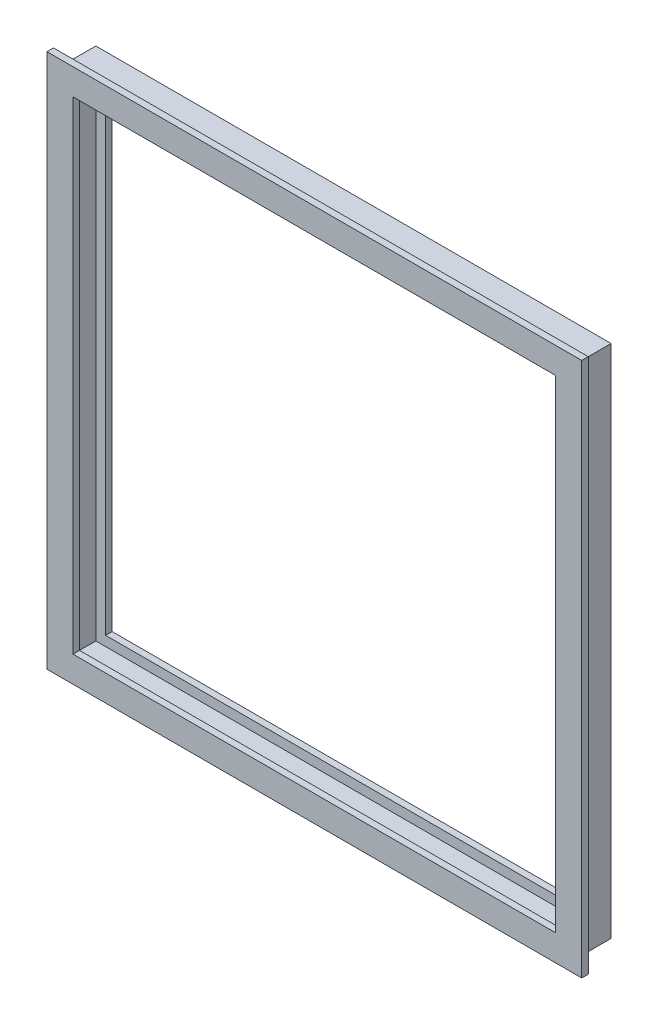
ISO-10303-21;
HEADER;
FILE_DESCRIPTION(('STEP AP214'),'2;1');
FILE_NAME('part.step','',(''),(''),'','','');
FILE_SCHEMA(('AUTOMOTIVE_DESIGN { 1 0 10303 214 1 1 1 1 }'));
ENDSEC;
DATA;
#1=APPLICATION_CONTEXT('core data for automotive mechanical design processes');
#2=APPLICATION_PROTOCOL_DEFINITION('international standard','automotive_design',2000,#1);
#3=PRODUCT_CONTEXT('',#1,'mechanical');
#4=PRODUCT('Part','Part','',(#3));
#5=PRODUCT_RELATED_PRODUCT_CATEGORY('part','',(#4));
#6=PRODUCT_DEFINITION_FORMATION('','',#4);
#7=PRODUCT_DEFINITION_CONTEXT('part definition',#1,'design');
#8=PRODUCT_DEFINITION('design','',#6,#7);
#9=PRODUCT_DEFINITION_SHAPE('','',#8);
#10=(LENGTH_UNIT() NAMED_UNIT(*) SI_UNIT(.MILLI.,.METRE.));
#11=(NAMED_UNIT(*) PLANE_ANGLE_UNIT() SI_UNIT($,.RADIAN.));
#12=(NAMED_UNIT(*) SI_UNIT($,.STERADIAN.) SOLID_ANGLE_UNIT());
#13=UNCERTAINTY_MEASURE_WITH_UNIT(LENGTH_MEASURE(1.E-05),#10,'distance_accuracy_value','');
#14=(GEOMETRIC_REPRESENTATION_CONTEXT(3) GLOBAL_UNCERTAINTY_ASSIGNED_CONTEXT((#13)) GLOBAL_UNIT_ASSIGNED_CONTEXT((#10,
#11,#12)) REPRESENTATION_CONTEXT('',''));
#15=CARTESIAN_POINT('',(0.,0.,0.));
#16=DIRECTION('',(0.,0.,1.));
#17=DIRECTION('',(1.,0.,0.));
#18=AXIS2_PLACEMENT_3D('',#15,#16,#17);
#19=CARTESIAN_POINT('',(130.75125,-117.475,-4.7625));
#20=DIRECTION('',(0.,1.,0.));
#21=DIRECTION('',(-1.,0.,0.));
#22=AXIS2_PLACEMENT_3D('',#19,#20,#21);
#23=PLANE('',#22);
#24=DIRECTION('',(-1.,0.,0.));
#25=VECTOR('',#24,1.);
#26=CARTESIAN_POINT('',(130.75125,-117.475,-7.9375));
#27=LINE('',#26,#25);
#28=CARTESIAN_POINT('',(117.475,-117.475,-7.9375));
#29=VERTEX_POINT('',#28);
#30=CARTESIAN_POINT('',(-117.475,-117.475,-7.9375));
#31=VERTEX_POINT('',#30);
#32=EDGE_CURVE('E38',#29,#31,#27,.T.);
#33=ORIENTED_EDGE('',*,*,#32,.T.);
#34=DIRECTION('',(0.,0.,1.));
#35=VECTOR('',#34,1.);
#36=CARTESIAN_POINT('',(-117.475,-117.475,-4.7625));
#37=LINE('',#36,#35);
#38=CARTESIAN_POINT('',(-117.475,-117.475,-4.7625));
#39=VERTEX_POINT('',#38);
#40=EDGE_CURVE('E124',#31,#39,#37,.T.);
#41=ORIENTED_EDGE('',*,*,#40,.T.);
#42=DIRECTION('',(-1.,0.,0.));
#43=VECTOR('',#42,1.);
#44=CARTESIAN_POINT('',(130.75125,-117.475,-4.7625));
#45=LINE('',#44,#43);
#46=CARTESIAN_POINT('',(117.475,-117.475,-4.7625));
#47=VERTEX_POINT('',#46);
#48=EDGE_CURVE('E158',#47,#39,#45,.T.);
#49=ORIENTED_EDGE('',*,*,#48,.F.);
#50=DIRECTION('',(0.,0.,1.));
#51=VECTOR('',#50,1.);
#52=CARTESIAN_POINT('',(117.475,-117.475,-4.7625));
#53=LINE('',#52,#51);
#54=EDGE_CURVE('E127',#29,#47,#53,.T.);
#55=ORIENTED_EDGE('',*,*,#54,.F.);
#56=EDGE_LOOP('',(#33,#41,#49,#55));
#57=FACE_BOUND('',#56,.T.);
#58=ADVANCED_FACE('F35',(#57),#23,.T.);
#59=CARTESIAN_POINT('',(130.75125,-122.2375,7.93749999999999));
#60=DIRECTION('',(0.,1.,0.));
#61=DIRECTION('',(-1.,0.,0.));
#62=AXIS2_PLACEMENT_3D('',#59,#60,#61);
#63=PLANE('',#62);
#64=DIRECTION('',(-1.,0.,0.));
#65=VECTOR('',#64,1.);
#66=CARTESIAN_POINT('',(130.75125,-122.2375,-4.76250000000001));
#67=LINE('',#66,#65);
#68=CARTESIAN_POINT('',(122.2375,-122.2375,-4.76250000000001));
#69=VERTEX_POINT('',#68);
#70=CARTESIAN_POINT('',(-122.2375,-122.2375,-4.76250000000001));
#71=VERTEX_POINT('',#70);
#72=EDGE_CURVE('E160',#69,#71,#67,.T.);
#73=ORIENTED_EDGE('',*,*,#72,.T.);
#74=DIRECTION('',(0.,0.,1.));
#75=VECTOR('',#74,1.);
#76=CARTESIAN_POINT('',(-122.2375,-122.2375,7.93749999999999));
#77=LINE('',#76,#75);
#78=CARTESIAN_POINT('',(-122.2375,-122.2375,7.93749999999999));
#79=VERTEX_POINT('',#78);
#80=EDGE_CURVE('E142',#71,#79,#77,.T.);
#81=ORIENTED_EDGE('',*,*,#80,.T.);
#82=DIRECTION('',(-1.,0.,0.));
#83=VECTOR('',#82,1.);
#84=CARTESIAN_POINT('',(130.75125,-122.2375,7.93749999999999));
#85=LINE('',#84,#83);
#86=CARTESIAN_POINT('',(122.2375,-122.2375,7.93749999999999));
#87=VERTEX_POINT('',#86);
#88=EDGE_CURVE('E162',#87,#79,#85,.T.);
#89=ORIENTED_EDGE('',*,*,#88,.F.);
#90=DIRECTION('',(0.,0.,1.));
#91=VECTOR('',#90,1.);
#92=CARTESIAN_POINT('',(122.2375,-122.2375,7.93749999999999));
#93=LINE('',#92,#91);
#94=EDGE_CURVE('E242',#69,#87,#93,.T.);
#95=ORIENTED_EDGE('',*,*,#94,.F.);
#96=EDGE_LOOP('',(#73,#81,#89,#95));
#97=FACE_BOUND('',#96,.T.);
#98=ADVANCED_FACE('F370',(#97),#63,.T.);
#99=CARTESIAN_POINT('',(130.75125,-117.475,11.1125));
#100=DIRECTION('',(0.,1.,0.));
#101=DIRECTION('',(-1.,0.,0.));
#102=AXIS2_PLACEMENT_3D('',#99,#100,#101);
#103=PLANE('',#102);
#104=DIRECTION('',(-1.,0.,0.));
#105=VECTOR('',#104,1.);
#106=CARTESIAN_POINT('',(130.75125,-117.475,7.9375));
#107=LINE('',#106,#105);
#108=CARTESIAN_POINT('',(117.475,-117.475,7.9375));
#109=VERTEX_POINT('',#108);
#110=CARTESIAN_POINT('',(-117.475,-117.475,7.9375));
#111=VERTEX_POINT('',#110);
#112=EDGE_CURVE('E165',#109,#111,#107,.T.);
#113=ORIENTED_EDGE('',*,*,#112,.T.);
#114=DIRECTION('',(0.,0.,1.));
#115=VECTOR('',#114,1.);
#116=CARTESIAN_POINT('',(-117.475,-117.475,11.1125));
#117=LINE('',#116,#115);
#118=CARTESIAN_POINT('',(-117.475,-117.475,11.1125));
#119=VERTEX_POINT('',#118);
#120=EDGE_CURVE('E272',#111,#119,#117,.T.);
#121=ORIENTED_EDGE('',*,*,#120,.T.);
#122=DIRECTION('',(-1.,0.,0.));
#123=VECTOR('',#122,1.);
#124=CARTESIAN_POINT('',(130.75125,-117.475,11.1125));
#125=LINE('',#124,#123);
#126=CARTESIAN_POINT('',(117.475,-117.475,11.1125));
#127=VERTEX_POINT('',#126);
#128=EDGE_CURVE('E167',#127,#119,#125,.T.);
#129=ORIENTED_EDGE('',*,*,#128,.F.);
#130=DIRECTION('',(0.,0.,1.));
#131=VECTOR('',#130,1.);
#132=CARTESIAN_POINT('',(117.475,-117.475,11.1125));
#133=LINE('',#132,#131);
#134=EDGE_CURVE('E239',#109,#127,#133,.T.);
#135=ORIENTED_EDGE('',*,*,#134,.F.);
#136=EDGE_LOOP('',(#113,#121,#129,#135));
#137=FACE_BOUND('',#136,.T.);
#138=ADVANCED_FACE('F372',(#137),#103,.T.);
#139=CARTESIAN_POINT('',(130.75125,-130.175,7.93750000000001));
#140=DIRECTION('',(0.,-1.,0.));
#141=DIRECTION('',(1.,0.,0.));
#142=AXIS2_PLACEMENT_3D('',#139,#140,#141);
#143=PLANE('',#142);
#144=DIRECTION('',(-1.,0.,0.));
#145=VECTOR('',#144,1.);
#146=CARTESIAN_POINT('',(130.75125,-130.175,11.1125));
#147=LINE('',#146,#145);
#148=CARTESIAN_POINT('',(130.175,-130.175,11.1125));
#149=VERTEX_POINT('',#148);
#150=CARTESIAN_POINT('',(-130.175,-130.175,11.1125));
#151=VERTEX_POINT('',#150);
#152=EDGE_CURVE('E170',#149,#151,#147,.T.);
#153=ORIENTED_EDGE('',*,*,#152,.T.);
#154=DIRECTION('',(0.,0.,-1.));
#155=VECTOR('',#154,1.);
#156=CARTESIAN_POINT('',(-130.175,-130.175,7.93750000000001));
#157=LINE('',#156,#155);
#158=CARTESIAN_POINT('',(-130.175,-130.175,7.93750000000001));
#159=VERTEX_POINT('',#158);
#160=EDGE_CURVE('E270',#151,#159,#157,.T.);
#161=ORIENTED_EDGE('',*,*,#160,.T.);
#162=DIRECTION('',(-1.,0.,0.));
#163=VECTOR('',#162,1.);
#164=CARTESIAN_POINT('',(130.75125,-130.175,7.93750000000001));
#165=LINE('',#164,#163);
#166=CARTESIAN_POINT('',(130.175,-130.175,7.93750000000001));
#167=VERTEX_POINT('',#166);
#168=EDGE_CURVE('E172',#167,#159,#165,.T.);
#169=ORIENTED_EDGE('',*,*,#168,.F.);
#170=DIRECTION('',(0.,0.,-1.));
#171=VECTOR('',#170,1.);
#172=CARTESIAN_POINT('',(130.175,-130.175,7.93750000000001));
#173=LINE('',#172,#171);
#174=EDGE_CURVE('E236',#149,#167,#173,.T.);
#175=ORIENTED_EDGE('',*,*,#174,.F.);
#176=EDGE_LOOP('',(#153,#161,#169,#175));
#177=FACE_BOUND('',#176,.T.);
#178=ADVANCED_FACE('F377',(#177),#143,.T.);
#179=CARTESIAN_POINT('',(130.75125,-125.4125,-7.9375));
#180=DIRECTION('',(0.,-1.,0.));
#181=DIRECTION('',(1.,0.,0.));
#182=AXIS2_PLACEMENT_3D('',#179,#180,#181);
#183=PLANE('',#182);
#184=DIRECTION('',(-1.,0.,0.));
#185=VECTOR('',#184,1.);
#186=CARTESIAN_POINT('',(130.75125,-125.4125,7.9375));
#187=LINE('',#186,#185);
#188=CARTESIAN_POINT('',(125.4125,-125.4125,7.9375));
#189=VERTEX_POINT('',#188);
#190=CARTESIAN_POINT('',(-125.4125,-125.4125,7.9375));
#191=VERTEX_POINT('',#190);
#192=EDGE_CURVE('E118',#189,#191,#187,.T.);
#193=ORIENTED_EDGE('',*,*,#192,.T.);
#194=DIRECTION('',(0.,0.,-1.));
#195=VECTOR('',#194,1.);
#196=CARTESIAN_POINT('',(-125.4125,-125.4125,-7.9375));
#197=LINE('',#196,#195);
#198=CARTESIAN_POINT('',(-125.4125,-125.4125,-7.9375));
#199=VERTEX_POINT('',#198);
#200=EDGE_CURVE('E184',#191,#199,#197,.T.);
#201=ORIENTED_EDGE('',*,*,#200,.T.);
#202=DIRECTION('',(-1.,0.,0.));
#203=VECTOR('',#202,1.);
#204=CARTESIAN_POINT('',(130.75125,-125.4125,-7.9375));
#205=LINE('',#204,#203);
#206=CARTESIAN_POINT('',(125.4125,-125.4125,-7.9375));
#207=VERTEX_POINT('',#206);
#208=EDGE_CURVE('E132',#207,#199,#205,.T.);
#209=ORIENTED_EDGE('',*,*,#208,.F.);
#210=DIRECTION('',(0.,0.,-1.));
#211=VECTOR('',#210,1.);
#212=CARTESIAN_POINT('',(125.4125,-125.4125,-7.9375));
#213=LINE('',#212,#211);
#214=EDGE_CURVE('E199',#189,#207,#213,.T.);
#215=ORIENTED_EDGE('',*,*,#214,.F.);
#216=EDGE_LOOP('',(#193,#201,#209,#215));
#217=FACE_BOUND('',#216,.T.);
#218=ADVANCED_FACE('F417',(#217),#183,.T.);
#219=CARTESIAN_POINT('',(-117.475,-130.75125,-4.7625));
#220=DIRECTION('',(1.,0.,0.));
#221=DIRECTION('',(0.,0.,-1.));
#222=AXIS2_PLACEMENT_3D('',#219,#220,#221);
#223=PLANE('',#222);
#224=DIRECTION('',(0.,1.,0.));
#225=VECTOR('',#224,1.);
#226=CARTESIAN_POINT('',(-117.475,-130.75125,-7.9375));
#227=LINE('',#226,#225);
#228=CARTESIAN_POINT('',(-117.475,117.475,-7.9375));
#229=VERTEX_POINT('',#228);
#230=EDGE_CURVE('E138',#31,#229,#227,.T.);
#231=ORIENTED_EDGE('',*,*,#230,.T.);
#232=DIRECTION('',(0.,0.,1.));
#233=VECTOR('',#232,1.);
#234=CARTESIAN_POINT('',(-117.475,117.475,-4.7625));
#235=LINE('',#234,#233);
#236=CARTESIAN_POINT('',(-117.475,117.475,-4.7625));
#237=VERTEX_POINT('',#236);
#238=EDGE_CURVE('E194',#229,#237,#235,.T.);
#239=ORIENTED_EDGE('',*,*,#238,.T.);
#240=DIRECTION('',(0.,1.,0.));
#241=VECTOR('',#240,1.);
#242=CARTESIAN_POINT('',(-117.475,-130.75125,-4.7625));
#243=LINE('',#242,#241);
#244=EDGE_CURVE('E141',#39,#237,#243,.T.);
#245=ORIENTED_EDGE('',*,*,#244,.F.);
#246=ORIENTED_EDGE('',*,*,#40,.F.);
#247=EDGE_LOOP('',(#231,#239,#245,#246));
#248=FACE_BOUND('',#247,.T.);
#249=ADVANCED_FACE('F136',(#248),#223,.T.);
#250=CARTESIAN_POINT('',(-122.2375,-130.75125,7.93749999999999));
#251=DIRECTION('',(1.,0.,0.));
#252=DIRECTION('',(0.,0.,-1.));
#253=AXIS2_PLACEMENT_3D('',#250,#251,#252);
#254=PLANE('',#253);
#255=DIRECTION('',(0.,1.,0.));
#256=VECTOR('',#255,1.);
#257=CARTESIAN_POINT('',(-122.2375,-130.75125,-4.76250000000001));
#258=LINE('',#257,#256);
#259=CARTESIAN_POINT('',(-122.2375,122.2375,-4.76250000000001));
#260=VERTEX_POINT('',#259);
#261=EDGE_CURVE('E276',#71,#260,#258,.T.);
#262=ORIENTED_EDGE('',*,*,#261,.T.);
#263=DIRECTION('',(0.,0.,1.));
#264=VECTOR('',#263,1.);
#265=CARTESIAN_POINT('',(-122.2375,122.2375,7.93749999999999));
#266=LINE('',#265,#264);
#267=CARTESIAN_POINT('',(-122.2375,122.2375,7.93749999999999));
#268=VERTEX_POINT('',#267);
#269=EDGE_CURVE('E207',#260,#268,#266,.T.);
#270=ORIENTED_EDGE('',*,*,#269,.T.);
#271=DIRECTION('',(0.,1.,0.));
#272=VECTOR('',#271,1.);
#273=CARTESIAN_POINT('',(-122.2375,-130.75125,7.93749999999999));
#274=LINE('',#273,#272);
#275=EDGE_CURVE('E279',#79,#268,#274,.T.);
#276=ORIENTED_EDGE('',*,*,#275,.F.);
#277=ORIENTED_EDGE('',*,*,#80,.F.);
#278=EDGE_LOOP('',(#262,#270,#276,#277));
#279=FACE_BOUND('',#278,.T.);
#280=ADVANCED_FACE('F364',(#279),#254,.T.);
#281=CARTESIAN_POINT('',(-117.475,-130.75125,11.1125));
#282=DIRECTION('',(1.,0.,0.));
#283=DIRECTION('',(0.,0.,-1.));
#284=AXIS2_PLACEMENT_3D('',#281,#282,#283);
#285=PLANE('',#284);
#286=DIRECTION('',(0.,1.,0.));
#287=VECTOR('',#286,1.);
#288=CARTESIAN_POINT('',(-117.475,-130.75125,7.9375));
#289=LINE('',#288,#287);
#290=CARTESIAN_POINT('',(-117.475,117.475,7.9375));
#291=VERTEX_POINT('',#290);
#292=EDGE_CURVE('E282',#111,#291,#289,.T.);
#293=ORIENTED_EDGE('',*,*,#292,.T.);
#294=DIRECTION('',(0.,0.,1.));
#295=VECTOR('',#294,1.);
#296=CARTESIAN_POINT('',(-117.475,117.475,11.1125));
#297=LINE('',#296,#295);
#298=CARTESIAN_POINT('',(-117.475,117.475,11.1125));
#299=VERTEX_POINT('',#298);
#300=EDGE_CURVE('E197',#291,#299,#297,.T.);
#301=ORIENTED_EDGE('',*,*,#300,.T.);
#302=DIRECTION('',(0.,1.,0.));
#303=VECTOR('',#302,1.);
#304=CARTESIAN_POINT('',(-117.475,-130.75125,11.1125));
#305=LINE('',#304,#303);
#306=EDGE_CURVE('E285',#119,#299,#305,.T.);
#307=ORIENTED_EDGE('',*,*,#306,.F.);
#308=ORIENTED_EDGE('',*,*,#120,.F.);
#309=EDGE_LOOP('',(#293,#301,#307,#308));
#310=FACE_BOUND('',#309,.T.);
#311=ADVANCED_FACE('F409',(#310),#285,.T.);
#312=CARTESIAN_POINT('',(-130.175,-130.75125,7.93750000000001));
#313=DIRECTION('',(-1.,0.,0.));
#314=DIRECTION('',(0.,0.,1.));
#315=AXIS2_PLACEMENT_3D('',#312,#313,#314);
#316=PLANE('',#315);
#317=DIRECTION('',(0.,1.,0.));
#318=VECTOR('',#317,1.);
#319=CARTESIAN_POINT('',(-130.175,-130.75125,11.1125));
#320=LINE('',#319,#318);
#321=CARTESIAN_POINT('',(-130.175,130.175,11.1125));
#322=VERTEX_POINT('',#321);
#323=EDGE_CURVE('E288',#151,#322,#320,.T.);
#324=ORIENTED_EDGE('',*,*,#323,.T.);
#325=DIRECTION('',(0.,0.,-1.));
#326=VECTOR('',#325,1.);
#327=CARTESIAN_POINT('',(-130.175,130.175,7.93750000000001));
#328=LINE('',#327,#326);
#329=CARTESIAN_POINT('',(-130.175,130.175,7.93750000000001));
#330=VERTEX_POINT('',#329);
#331=EDGE_CURVE('E193',#322,#330,#328,.T.);
#332=ORIENTED_EDGE('',*,*,#331,.T.);
#333=DIRECTION('',(0.,1.,0.));
#334=VECTOR('',#333,1.);
#335=CARTESIAN_POINT('',(-130.175,-130.75125,7.93750000000001));
#336=LINE('',#335,#334);
#337=EDGE_CURVE('E291',#159,#330,#336,.T.);
#338=ORIENTED_EDGE('',*,*,#337,.F.);
#339=ORIENTED_EDGE('',*,*,#160,.F.);
#340=EDGE_LOOP('',(#324,#332,#338,#339));
#341=FACE_BOUND('',#340,.T.);
#342=ADVANCED_FACE('F406',(#341),#316,.T.);
#343=CARTESIAN_POINT('',(-125.4125,-130.75125,-7.9375));
#344=DIRECTION('',(-1.,0.,0.));
#345=DIRECTION('',(0.,0.,1.));
#346=AXIS2_PLACEMENT_3D('',#343,#344,#345);
#347=PLANE('',#346);
#348=DIRECTION('',(0.,1.,0.));
#349=VECTOR('',#348,1.);
#350=CARTESIAN_POINT('',(-125.4125,-130.75125,7.9375));
#351=LINE('',#350,#349);
#352=CARTESIAN_POINT('',(-125.4125,125.4125,7.9375));
#353=VERTEX_POINT('',#352);
#354=EDGE_CURVE('E154',#191,#353,#351,.T.);
#355=ORIENTED_EDGE('',*,*,#354,.T.);
#356=DIRECTION('',(0.,0.,-1.));
#357=VECTOR('',#356,1.);
#358=CARTESIAN_POINT('',(-125.4125,125.4125,-7.9375));
#359=LINE('',#358,#357);
#360=CARTESIAN_POINT('',(-125.4125,125.4125,-7.9375));
#361=VERTEX_POINT('',#360);
#362=EDGE_CURVE('E187',#353,#361,#359,.T.);
#363=ORIENTED_EDGE('',*,*,#362,.T.);
#364=DIRECTION('',(0.,1.,0.));
#365=VECTOR('',#364,1.);
#366=CARTESIAN_POINT('',(-125.4125,-130.75125,-7.9375));
#367=LINE('',#366,#365);
#368=EDGE_CURVE('E148',#199,#361,#367,.T.);
#369=ORIENTED_EDGE('',*,*,#368,.F.);
#370=ORIENTED_EDGE('',*,*,#200,.F.);
#371=EDGE_LOOP('',(#355,#363,#369,#370));
#372=FACE_BOUND('',#371,.T.);
#373=ADVANCED_FACE('F183',(#372),#347,.T.);
#374=CARTESIAN_POINT('',(117.475,130.75125,-4.7625));
#375=DIRECTION('',(-1.,0.,0.));
#376=DIRECTION('',(0.,0.,1.));
#377=AXIS2_PLACEMENT_3D('',#374,#375,#376);
#378=PLANE('',#377);
#379=DIRECTION('',(0.,-1.,0.));
#380=VECTOR('',#379,1.);
#381=CARTESIAN_POINT('',(117.475,130.75125,-7.9375));
#382=LINE('',#381,#380);
#383=CARTESIAN_POINT('',(117.475,117.475,-7.9375));
#384=VERTEX_POINT('',#383);
#385=EDGE_CURVE('E245',#384,#29,#382,.T.);
#386=ORIENTED_EDGE('',*,*,#385,.T.);
#387=ORIENTED_EDGE('',*,*,#54,.T.);
#388=DIRECTION('',(0.,-1.,0.));
#389=VECTOR('',#388,1.);
#390=CARTESIAN_POINT('',(117.475,130.75125,-4.7625));
#391=LINE('',#390,#389);
#392=CARTESIAN_POINT('',(117.475,117.475,-4.7625));
#393=VERTEX_POINT('',#392);
#394=EDGE_CURVE('E147',#393,#47,#391,.T.);
#395=ORIENTED_EDGE('',*,*,#394,.F.);
#396=DIRECTION('',(0.,0.,1.));
#397=VECTOR('',#396,1.);
#398=CARTESIAN_POINT('',(117.475,117.475,-4.7625));
#399=LINE('',#398,#397);
#400=EDGE_CURVE('E214',#384,#393,#399,.T.);
#401=ORIENTED_EDGE('',*,*,#400,.F.);
#402=EDGE_LOOP('',(#386,#387,#395,#401));
#403=FACE_BOUND('',#402,.T.);
#404=ADVANCED_FACE('F401',(#403),#378,.T.);
#405=CARTESIAN_POINT('',(122.2375,130.75125,7.93749999999999));
#406=DIRECTION('',(-1.,0.,0.));
#407=DIRECTION('',(0.,0.,1.));
#408=AXIS2_PLACEMENT_3D('',#405,#406,#407);
#409=PLANE('',#408);
#410=DIRECTION('',(0.,-1.,0.));
#411=VECTOR('',#410,1.);
#412=CARTESIAN_POINT('',(122.2375,130.75125,-4.76250000000001));
#413=LINE('',#412,#411);
#414=CARTESIAN_POINT('',(122.2375,122.2375,-4.76250000000001));
#415=VERTEX_POINT('',#414);
#416=EDGE_CURVE('E151',#415,#69,#413,.T.);
#417=ORIENTED_EDGE('',*,*,#416,.T.);
#418=ORIENTED_EDGE('',*,*,#94,.T.);
#419=DIRECTION('',(0.,-1.,0.));
#420=VECTOR('',#419,1.);
#421=CARTESIAN_POINT('',(122.2375,130.75125,7.93749999999999));
#422=LINE('',#421,#420);
#423=CARTESIAN_POINT('',(122.2375,122.2375,7.93749999999999));
#424=VERTEX_POINT('',#423);
#425=EDGE_CURVE('E249',#424,#87,#422,.T.);
#426=ORIENTED_EDGE('',*,*,#425,.F.);
#427=DIRECTION('',(0.,0.,1.));
#428=VECTOR('',#427,1.);
#429=CARTESIAN_POINT('',(122.2375,122.2375,7.93749999999999));
#430=LINE('',#429,#428);
#431=EDGE_CURVE('E318',#415,#424,#430,.T.);
#432=ORIENTED_EDGE('',*,*,#431,.F.);
#433=EDGE_LOOP('',(#417,#418,#426,#432));
#434=FACE_BOUND('',#433,.T.);
#435=ADVANCED_FACE('F353',(#434),#409,.T.);
#436=CARTESIAN_POINT('',(117.475,130.75125,11.1125));
#437=DIRECTION('',(-1.,0.,0.));
#438=DIRECTION('',(0.,0.,1.));
#439=AXIS2_PLACEMENT_3D('',#436,#437,#438);
#440=PLANE('',#439);
#441=DIRECTION('',(0.,-1.,0.));
#442=VECTOR('',#441,1.);
#443=CARTESIAN_POINT('',(117.475,130.75125,7.9375));
#444=LINE('',#443,#442);
#445=CARTESIAN_POINT('',(117.475,117.475,7.9375));
#446=VERTEX_POINT('',#445);
#447=EDGE_CURVE('E252',#446,#109,#444,.T.);
#448=ORIENTED_EDGE('',*,*,#447,.T.);
#449=ORIENTED_EDGE('',*,*,#134,.T.);
#450=DIRECTION('',(0.,-1.,0.));
#451=VECTOR('',#450,1.);
#452=CARTESIAN_POINT('',(117.475,130.75125,11.1125));
#453=LINE('',#452,#451);
#454=CARTESIAN_POINT('',(117.475,117.475,11.1125));
#455=VERTEX_POINT('',#454);
#456=EDGE_CURVE('E255',#455,#127,#453,.T.);
#457=ORIENTED_EDGE('',*,*,#456,.F.);
#458=DIRECTION('',(0.,0.,1.));
#459=VECTOR('',#458,1.);
#460=CARTESIAN_POINT('',(117.475,117.475,11.1125));
#461=LINE('',#460,#459);
#462=EDGE_CURVE('E316',#446,#455,#461,.T.);
#463=ORIENTED_EDGE('',*,*,#462,.F.);
#464=EDGE_LOOP('',(#448,#449,#457,#463));
#465=FACE_BOUND('',#464,.T.);
#466=ADVANCED_FACE('F395',(#465),#440,.T.);
#467=CARTESIAN_POINT('',(130.175,130.75125,7.93750000000001));
#468=DIRECTION('',(1.,0.,0.));
#469=DIRECTION('',(0.,0.,-1.));
#470=AXIS2_PLACEMENT_3D('',#467,#468,#469);
#471=PLANE('',#470);
#472=DIRECTION('',(0.,-1.,0.));
#473=VECTOR('',#472,1.);
#474=CARTESIAN_POINT('',(130.175,130.75125,11.1125));
#475=LINE('',#474,#473);
#476=CARTESIAN_POINT('',(130.175,130.175,11.1125));
#477=VERTEX_POINT('',#476);
#478=EDGE_CURVE('E258',#477,#149,#475,.T.);
#479=ORIENTED_EDGE('',*,*,#478,.T.);
#480=ORIENTED_EDGE('',*,*,#174,.T.);
#481=DIRECTION('',(0.,-1.,0.));
#482=VECTOR('',#481,1.);
#483=CARTESIAN_POINT('',(130.175,130.75125,7.93750000000001));
#484=LINE('',#483,#482);
#485=CARTESIAN_POINT('',(130.175,130.175,7.93750000000001));
#486=VERTEX_POINT('',#485);
#487=EDGE_CURVE('E261',#486,#167,#484,.T.);
#488=ORIENTED_EDGE('',*,*,#487,.F.);
#489=DIRECTION('',(0.,0.,-1.));
#490=VECTOR('',#489,1.);
#491=CARTESIAN_POINT('',(130.175,130.175,7.93750000000001));
#492=LINE('',#491,#490);
#493=EDGE_CURVE('E309',#477,#486,#492,.T.);
#494=ORIENTED_EDGE('',*,*,#493,.F.);
#495=EDGE_LOOP('',(#479,#480,#488,#494));
#496=FACE_BOUND('',#495,.T.);
#497=ADVANCED_FACE('F392',(#496),#471,.T.);
#498=CARTESIAN_POINT('',(125.4125,130.75125,-7.9375));
#499=DIRECTION('',(1.,0.,0.));
#500=DIRECTION('',(0.,0.,-1.));
#501=AXIS2_PLACEMENT_3D('',#498,#499,#500);
#502=PLANE('',#501);
#503=DIRECTION('',(0.,-1.,0.));
#504=VECTOR('',#503,1.);
#505=CARTESIAN_POINT('',(125.4125,130.75125,7.9375));
#506=LINE('',#505,#504);
#507=CARTESIAN_POINT('',(125.4125,125.4125,7.9375));
#508=VERTEX_POINT('',#507);
#509=EDGE_CURVE('E264',#508,#189,#506,.T.);
#510=ORIENTED_EDGE('',*,*,#509,.T.);
#511=ORIENTED_EDGE('',*,*,#214,.T.);
#512=DIRECTION('',(0.,-1.,0.));
#513=VECTOR('',#512,1.);
#514=CARTESIAN_POINT('',(125.4125,130.75125,-7.9375));
#515=LINE('',#514,#513);
#516=CARTESIAN_POINT('',(125.4125,125.4125,-7.9375));
#517=VERTEX_POINT('',#516);
#518=EDGE_CURVE('E53',#517,#207,#515,.T.);
#519=ORIENTED_EDGE('',*,*,#518,.F.);
#520=DIRECTION('',(0.,0.,-1.));
#521=VECTOR('',#520,1.);
#522=CARTESIAN_POINT('',(125.4125,125.4125,-7.9375));
#523=LINE('',#522,#521);
#524=EDGE_CURVE('E202',#508,#517,#523,.T.);
#525=ORIENTED_EDGE('',*,*,#524,.F.);
#526=EDGE_LOOP('',(#510,#511,#519,#525));
#527=FACE_BOUND('',#526,.T.);
#528=ADVANCED_FACE('F389',(#527),#502,.T.);
#529=CARTESIAN_POINT('',(-130.75125,117.475,-4.7625));
#530=DIRECTION('',(0.,-1.,0.));
#531=DIRECTION('',(1.,0.,0.));
#532=AXIS2_PLACEMENT_3D('',#529,#530,#531);
#533=PLANE('',#532);
#534=ORIENTED_EDGE('',*,*,#238,.F.);
#535=DIRECTION('',(1.,0.,0.));
#536=VECTOR('',#535,1.);
#537=CARTESIAN_POINT('',(-130.75125,117.475,-7.9375));
#538=LINE('',#537,#536);
#539=EDGE_CURVE('E11',#229,#384,#538,.T.);
#540=ORIENTED_EDGE('',*,*,#539,.T.);
#541=ORIENTED_EDGE('',*,*,#400,.T.);
#542=DIRECTION('',(1.,0.,0.));
#543=VECTOR('',#542,1.);
#544=CARTESIAN_POINT('',(-130.75125,117.475,-4.7625));
#545=LINE('',#544,#543);
#546=EDGE_CURVE('E210',#237,#393,#545,.T.);
#547=ORIENTED_EDGE('',*,*,#546,.F.);
#548=EDGE_LOOP('',(#534,#540,#541,#547));
#549=FACE_BOUND('',#548,.T.);
#550=ADVANCED_FACE('F326',(#549),#533,.T.);
#551=CARTESIAN_POINT('',(-130.75125,122.2375,-4.76250000000001));
#552=DIRECTION('',(0.,0.,1.));
#553=DIRECTION('',(0.,-1.,0.));
#554=AXIS2_PLACEMENT_3D('',#551,#552,#553);
#555=PLANE('',#554);
#556=ORIENTED_EDGE('',*,*,#261,.F.);
#557=ORIENTED_EDGE('',*,*,#72,.F.);
#558=ORIENTED_EDGE('',*,*,#416,.F.);
#559=DIRECTION('',(1.,0.,0.));
#560=VECTOR('',#559,1.);
#561=CARTESIAN_POINT('',(-130.75125,122.2375,-4.76250000000001));
#562=LINE('',#561,#560);
#563=EDGE_CURVE('E213',#260,#415,#562,.T.);
#564=ORIENTED_EDGE('',*,*,#563,.F.);
#565=EDGE_LOOP('',(#556,#557,#558,#564));
#566=FACE_BOUND('',#565,.T.);
#567=ORIENTED_EDGE('',*,*,#48,.T.);
#568=ORIENTED_EDGE('',*,*,#244,.T.);
#569=ORIENTED_EDGE('',*,*,#546,.T.);
#570=ORIENTED_EDGE('',*,*,#394,.T.);
#571=EDGE_LOOP('',(#567,#568,#569,#570));
#572=FACE_BOUND('',#571,.T.);
#573=ADVANCED_FACE('F332',(#566,#572),#555,.T.);
#574=CARTESIAN_POINT('',(-130.75125,122.2375,7.93749999999999));
#575=DIRECTION('',(0.,-1.,0.));
#576=DIRECTION('',(1.,0.,0.));
#577=AXIS2_PLACEMENT_3D('',#574,#575,#576);
#578=PLANE('',#577);
#579=ORIENTED_EDGE('',*,*,#269,.F.);
#580=ORIENTED_EDGE('',*,*,#563,.T.);
#581=ORIENTED_EDGE('',*,*,#431,.T.);
#582=DIRECTION('',(1.,0.,0.));
#583=VECTOR('',#582,1.);
#584=CARTESIAN_POINT('',(-130.75125,122.2375,7.93749999999999));
#585=LINE('',#584,#583);
#586=EDGE_CURVE('E217',#268,#424,#585,.T.);
#587=ORIENTED_EDGE('',*,*,#586,.F.);
#588=EDGE_LOOP('',(#579,#580,#581,#587));
#589=FACE_BOUND('',#588,.T.);
#590=ADVANCED_FACE('F361',(#589),#578,.T.);
#591=CARTESIAN_POINT('',(-130.75125,117.475,7.9375));
#592=DIRECTION('',(0.,0.,-1.));
#593=DIRECTION('',(0.,1.,0.));
#594=AXIS2_PLACEMENT_3D('',#591,#592,#593);
#595=PLANE('',#594);
#596=ORIENTED_EDGE('',*,*,#292,.F.);
#597=ORIENTED_EDGE('',*,*,#112,.F.);
#598=ORIENTED_EDGE('',*,*,#447,.F.);
#599=DIRECTION('',(1.,0.,0.));
#600=VECTOR('',#599,1.);
#601=CARTESIAN_POINT('',(-130.75125,117.475,7.9375));
#602=LINE('',#601,#600);
#603=EDGE_CURVE('E220',#291,#446,#602,.T.);
#604=ORIENTED_EDGE('',*,*,#603,.F.);
#605=EDGE_LOOP('',(#596,#597,#598,#604));
#606=FACE_BOUND('',#605,.T.);
#607=ORIENTED_EDGE('',*,*,#88,.T.);
#608=ORIENTED_EDGE('',*,*,#275,.T.);
#609=ORIENTED_EDGE('',*,*,#586,.T.);
#610=ORIENTED_EDGE('',*,*,#425,.T.);
#611=EDGE_LOOP('',(#607,#608,#609,#610));
#612=FACE_BOUND('',#611,.T.);
#613=ADVANCED_FACE('F368',(#606,#612),#595,.T.);
#614=CARTESIAN_POINT('',(-130.75125,117.475,11.1125));
#615=DIRECTION('',(0.,-1.,0.));
#616=DIRECTION('',(1.,0.,0.));
#617=AXIS2_PLACEMENT_3D('',#614,#615,#616);
#618=PLANE('',#617);
#619=ORIENTED_EDGE('',*,*,#300,.F.);
#620=ORIENTED_EDGE('',*,*,#603,.T.);
#621=ORIENTED_EDGE('',*,*,#462,.T.);
#622=DIRECTION('',(1.,0.,0.));
#623=VECTOR('',#622,1.);
#624=CARTESIAN_POINT('',(-130.75125,117.475,11.1125));
#625=LINE('',#624,#623);
#626=EDGE_CURVE('E223',#299,#455,#625,.T.);
#627=ORIENTED_EDGE('',*,*,#626,.F.);
#628=EDGE_LOOP('',(#619,#620,#621,#627));
#629=FACE_BOUND('',#628,.T.);
#630=ADVANCED_FACE('F443',(#629),#618,.T.);
#631=CARTESIAN_POINT('',(-130.75125,130.175,11.1125));
#632=DIRECTION('',(0.,0.,1.));
#633=DIRECTION('',(1.,0.,0.));
#634=AXIS2_PLACEMENT_3D('',#631,#632,#633);
#635=PLANE('',#634);
#636=ORIENTED_EDGE('',*,*,#323,.F.);
#637=ORIENTED_EDGE('',*,*,#152,.F.);
#638=ORIENTED_EDGE('',*,*,#478,.F.);
#639=DIRECTION('',(1.,0.,0.));
#640=VECTOR('',#639,1.);
#641=CARTESIAN_POINT('',(-130.75125,130.175,11.1125));
#642=LINE('',#641,#640);
#643=EDGE_CURVE('E226',#322,#477,#642,.T.);
#644=ORIENTED_EDGE('',*,*,#643,.F.);
#645=EDGE_LOOP('',(#636,#637,#638,#644));
#646=FACE_BOUND('',#645,.T.);
#647=ORIENTED_EDGE('',*,*,#128,.T.);
#648=ORIENTED_EDGE('',*,*,#306,.T.);
#649=ORIENTED_EDGE('',*,*,#626,.T.);
#650=ORIENTED_EDGE('',*,*,#456,.T.);
#651=EDGE_LOOP('',(#647,#648,#649,#650));
#652=FACE_BOUND('',#651,.T.);
#653=ADVANCED_FACE('F427',(#646,#652),#635,.T.);
#654=CARTESIAN_POINT('',(-130.75125,130.175,7.93750000000001));
#655=DIRECTION('',(0.,1.,0.));
#656=DIRECTION('',(-1.,0.,0.));
#657=AXIS2_PLACEMENT_3D('',#654,#655,#656);
#658=PLANE('',#657);
#659=ORIENTED_EDGE('',*,*,#331,.F.);
#660=ORIENTED_EDGE('',*,*,#643,.T.);
#661=ORIENTED_EDGE('',*,*,#493,.T.);
#662=DIRECTION('',(1.,0.,0.));
#663=VECTOR('',#662,1.);
#664=CARTESIAN_POINT('',(-130.75125,130.175,7.93750000000001));
#665=LINE('',#664,#663);
#666=EDGE_CURVE('E229',#330,#486,#665,.T.);
#667=ORIENTED_EDGE('',*,*,#666,.F.);
#668=EDGE_LOOP('',(#659,#660,#661,#667));
#669=FACE_BOUND('',#668,.T.);
#670=ADVANCED_FACE('F306',(#669),#658,.T.);
#671=CARTESIAN_POINT('',(-130.75125,125.4125,7.9375));
#672=DIRECTION('',(0.,0.,-1.));
#673=DIRECTION('',(0.,1.,0.));
#674=AXIS2_PLACEMENT_3D('',#671,#672,#673);
#675=PLANE('',#674);
#676=ORIENTED_EDGE('',*,*,#354,.F.);
#677=ORIENTED_EDGE('',*,*,#192,.F.);
#678=ORIENTED_EDGE('',*,*,#509,.F.);
#679=DIRECTION('',(1.,0.,0.));
#680=VECTOR('',#679,1.);
#681=CARTESIAN_POINT('',(-130.75125,125.4125,7.9375));
#682=LINE('',#681,#680);
#683=EDGE_CURVE('E232',#353,#508,#682,.T.);
#684=ORIENTED_EDGE('',*,*,#683,.F.);
#685=EDGE_LOOP('',(#676,#677,#678,#684));
#686=FACE_BOUND('',#685,.T.);
#687=ORIENTED_EDGE('',*,*,#168,.T.);
#688=ORIENTED_EDGE('',*,*,#337,.T.);
#689=ORIENTED_EDGE('',*,*,#666,.T.);
#690=ORIENTED_EDGE('',*,*,#487,.T.);
#691=EDGE_LOOP('',(#687,#688,#689,#690));
#692=FACE_BOUND('',#691,.T.);
#693=ADVANCED_FACE('F297',(#686,#692),#675,.T.);
#694=CARTESIAN_POINT('',(-130.75125,125.4125,-7.9375));
#695=DIRECTION('',(0.,1.,0.));
#696=DIRECTION('',(-1.,0.,0.));
#697=AXIS2_PLACEMENT_3D('',#694,#695,#696);
#698=PLANE('',#697);
#699=ORIENTED_EDGE('',*,*,#362,.F.);
#700=ORIENTED_EDGE('',*,*,#683,.T.);
#701=ORIENTED_EDGE('',*,*,#524,.T.);
#702=DIRECTION('',(1.,0.,0.));
#703=VECTOR('',#702,1.);
#704=CARTESIAN_POINT('',(-130.75125,125.4125,-7.9375));
#705=LINE('',#704,#703);
#706=EDGE_CURVE('E44',#361,#517,#705,.T.);
#707=ORIENTED_EDGE('',*,*,#706,.F.);
#708=EDGE_LOOP('',(#699,#700,#701,#707));
#709=FACE_BOUND('',#708,.T.);
#710=ADVANCED_FACE('F381',(#709),#698,.T.);
#711=CARTESIAN_POINT('',(-130.75125,117.475,-7.9375));
#712=DIRECTION('',(0.,0.,-1.));
#713=DIRECTION('',(-1.,0.,0.));
#714=AXIS2_PLACEMENT_3D('',#711,#712,#713);
#715=PLANE('',#714);
#716=ORIENTED_EDGE('',*,*,#230,.F.);
#717=ORIENTED_EDGE('',*,*,#32,.F.);
#718=ORIENTED_EDGE('',*,*,#385,.F.);
#719=ORIENTED_EDGE('',*,*,#539,.F.);
#720=EDGE_LOOP('',(#716,#717,#718,#719));
#721=FACE_BOUND('',#720,.T.);
#722=ORIENTED_EDGE('',*,*,#208,.T.);
#723=ORIENTED_EDGE('',*,*,#368,.T.);
#724=ORIENTED_EDGE('',*,*,#706,.T.);
#725=ORIENTED_EDGE('',*,*,#518,.T.);
#726=EDGE_LOOP('',(#722,#723,#724,#725));
#727=FACE_BOUND('',#726,.T.);
#728=ADVANCED_FACE('F145',(#721,#727),#715,.T.);
#729=CLOSED_SHELL('',(#58,#98,#138,#178,#218,#249,#280,#311,#342,#373,#404,#435,#466,#497,#528,
#550,#573,#590,#613,#630,#653,#670,#693,#710,#728));
#730=MANIFOLD_SOLID_BREP('B2',#729);
#731=ADVANCED_BREP_SHAPE_REPRESENTATION('',(#18,#730),#14);
#732=SHAPE_DEFINITION_REPRESENTATION(#9,#731);
ENDSEC;
END-ISO-10303-21;
